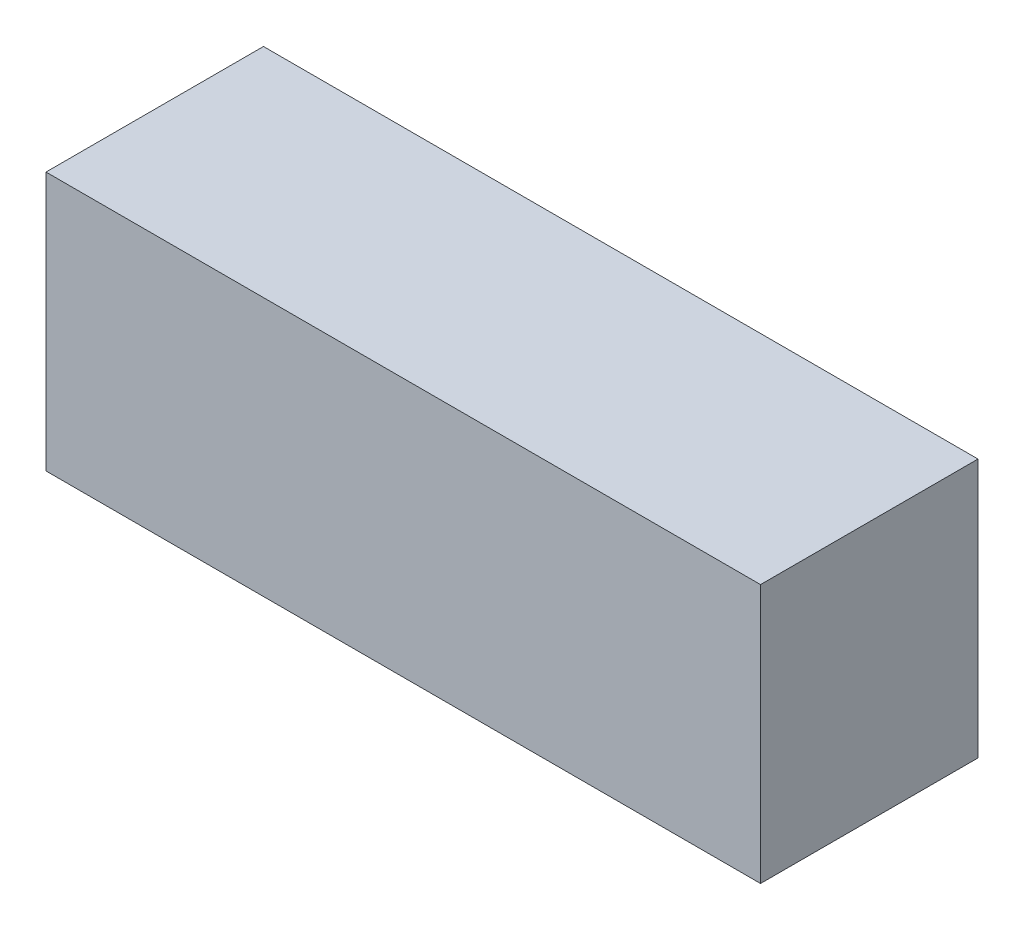
ISO-10303-21;
HEADER;
FILE_DESCRIPTION(('STEP AP214'),'2;1');
FILE_NAME('part.step','',(''),(''),'','','');
FILE_SCHEMA(('AUTOMOTIVE_DESIGN { 1 0 10303 214 1 1 1 1 }'));
ENDSEC;
DATA;
#1=APPLICATION_CONTEXT('core data for automotive mechanical design processes');
#2=APPLICATION_PROTOCOL_DEFINITION('international standard','automotive_design',2000,#1);
#3=PRODUCT_CONTEXT('',#1,'mechanical');
#4=PRODUCT('Part','Part','',(#3));
#5=PRODUCT_RELATED_PRODUCT_CATEGORY('part','',(#4));
#6=PRODUCT_DEFINITION_FORMATION('','',#4);
#7=PRODUCT_DEFINITION_CONTEXT('part definition',#1,'design');
#8=PRODUCT_DEFINITION('design','',#6,#7);
#9=PRODUCT_DEFINITION_SHAPE('','',#8);
#10=(LENGTH_UNIT() NAMED_UNIT(*) SI_UNIT(.MILLI.,.METRE.));
#11=(NAMED_UNIT(*) PLANE_ANGLE_UNIT() SI_UNIT($,.RADIAN.));
#12=(NAMED_UNIT(*) SI_UNIT($,.STERADIAN.) SOLID_ANGLE_UNIT());
#13=UNCERTAINTY_MEASURE_WITH_UNIT(LENGTH_MEASURE(1.E-05),#10,'distance_accuracy_value','');
#14=(GEOMETRIC_REPRESENTATION_CONTEXT(3) GLOBAL_UNCERTAINTY_ASSIGNED_CONTEXT((#13)) GLOBAL_UNIT_ASSIGNED_CONTEXT((#10,
#11,#12)) REPRESENTATION_CONTEXT('',''));
#15=CARTESIAN_POINT('',(0.,0.,0.));
#16=DIRECTION('',(0.,0.,1.));
#17=DIRECTION('',(1.,0.,0.));
#18=AXIS2_PLACEMENT_3D('',#15,#16,#17);
#19=CARTESIAN_POINT('',(26.289,-9.525,16.002));
#20=DIRECTION('',(-1.,0.,0.));
#21=DIRECTION('',(0.,0.,1.));
#22=AXIS2_PLACEMENT_3D('',#19,#20,#21);
#23=PLANE('',#22);
#24=DIRECTION('',(0.,1.,0.));
#25=VECTOR('',#24,1.);
#26=CARTESIAN_POINT('',(26.289,-9.525,0.));
#27=LINE('',#26,#25);
#28=CARTESIAN_POINT('',(26.289,-9.525,0.));
#29=VERTEX_POINT('',#28);
#30=CARTESIAN_POINT('',(26.289,9.525,0.));
#31=VERTEX_POINT('',#30);
#32=EDGE_CURVE('E99',#29,#31,#27,.T.);
#33=ORIENTED_EDGE('',*,*,#32,.T.);
#34=DIRECTION('',(0.,0.,-1.));
#35=VECTOR('',#34,1.);
#36=CARTESIAN_POINT('',(26.289,9.525,16.002));
#37=LINE('',#36,#35);
#38=CARTESIAN_POINT('',(26.289,9.525,16.002));
#39=VERTEX_POINT('',#38);
#40=EDGE_CURVE('E11',#39,#31,#37,.T.);
#41=ORIENTED_EDGE('',*,*,#40,.F.);
#42=DIRECTION('',(0.,1.,0.));
#43=VECTOR('',#42,1.);
#44=CARTESIAN_POINT('',(26.289,-9.525,16.002));
#45=LINE('',#44,#43);
#46=CARTESIAN_POINT('',(26.289,-9.525,16.002));
#47=VERTEX_POINT('',#46);
#48=EDGE_CURVE('E87',#47,#39,#45,.T.);
#49=ORIENTED_EDGE('',*,*,#48,.F.);
#50=DIRECTION('',(0.,0.,-1.));
#51=VECTOR('',#50,1.);
#52=CARTESIAN_POINT('',(26.289,-9.525,16.002));
#53=LINE('',#52,#51);
#54=EDGE_CURVE('E95',#47,#29,#53,.T.);
#55=ORIENTED_EDGE('',*,*,#54,.T.);
#56=EDGE_LOOP('',(#33,#41,#49,#55));
#57=FACE_BOUND('',#56,.T.);
#58=ADVANCED_FACE('F36',(#57),#23,.F.);
#59=CARTESIAN_POINT('',(-26.289,9.525,16.002));
#60=DIRECTION('',(0.,-1.,0.));
#61=DIRECTION('',(0.,0.,-1.));
#62=AXIS2_PLACEMENT_3D('',#59,#60,#61);
#63=PLANE('',#62);
#64=DIRECTION('',(-1.,0.,0.));
#65=VECTOR('',#64,1.);
#66=CARTESIAN_POINT('',(-26.289,9.525,0.));
#67=LINE('',#66,#65);
#68=CARTESIAN_POINT('',(-26.289,9.525,0.));
#69=VERTEX_POINT('',#68);
#70=EDGE_CURVE('E91',#31,#69,#67,.T.);
#71=ORIENTED_EDGE('',*,*,#70,.T.);
#72=DIRECTION('',(0.,0.,-1.));
#73=VECTOR('',#72,1.);
#74=CARTESIAN_POINT('',(-26.289,9.525,16.002));
#75=LINE('',#74,#73);
#76=CARTESIAN_POINT('',(-26.289,9.525,16.002));
#77=VERTEX_POINT('',#76);
#78=EDGE_CURVE('E44',#77,#69,#75,.T.);
#79=ORIENTED_EDGE('',*,*,#78,.F.);
#80=DIRECTION('',(-1.,0.,0.));
#81=VECTOR('',#80,1.);
#82=CARTESIAN_POINT('',(-26.289,9.525,16.002));
#83=LINE('',#82,#81);
#84=EDGE_CURVE('E82',#39,#77,#83,.T.);
#85=ORIENTED_EDGE('',*,*,#84,.F.);
#86=ORIENTED_EDGE('',*,*,#40,.T.);
#87=EDGE_LOOP('',(#71,#79,#85,#86));
#88=FACE_BOUND('',#87,.T.);
#89=ADVANCED_FACE('F90',(#88),#63,.F.);
#90=CARTESIAN_POINT('',(-26.289,-9.525,16.002));
#91=DIRECTION('',(1.,0.,0.));
#92=DIRECTION('',(0.,0.,-1.));
#93=AXIS2_PLACEMENT_3D('',#90,#91,#92);
#94=PLANE('',#93);
#95=DIRECTION('',(0.,-1.,0.));
#96=VECTOR('',#95,1.);
#97=CARTESIAN_POINT('',(-26.289,-9.525,0.));
#98=LINE('',#97,#96);
#99=CARTESIAN_POINT('',(-26.289,-9.525,0.));
#100=VERTEX_POINT('',#99);
#101=EDGE_CURVE('E69',#69,#100,#98,.T.);
#102=ORIENTED_EDGE('',*,*,#101,.T.);
#103=DIRECTION('',(0.,0.,-1.));
#104=VECTOR('',#103,1.);
#105=CARTESIAN_POINT('',(-26.289,-9.525,16.002));
#106=LINE('',#105,#104);
#107=CARTESIAN_POINT('',(-26.289,-9.525,16.002));
#108=VERTEX_POINT('',#107);
#109=EDGE_CURVE('E92',#108,#100,#106,.T.);
#110=ORIENTED_EDGE('',*,*,#109,.F.);
#111=DIRECTION('',(0.,-1.,0.));
#112=VECTOR('',#111,1.);
#113=CARTESIAN_POINT('',(-26.289,-9.525,16.002));
#114=LINE('',#113,#112);
#115=EDGE_CURVE('E85',#77,#108,#114,.T.);
#116=ORIENTED_EDGE('',*,*,#115,.F.);
#117=ORIENTED_EDGE('',*,*,#78,.T.);
#118=EDGE_LOOP('',(#102,#110,#116,#117));
#119=FACE_BOUND('',#118,.T.);
#120=ADVANCED_FACE('F93',(#119),#94,.F.);
#121=CARTESIAN_POINT('',(-26.289,-9.525,16.002));
#122=DIRECTION('',(0.,1.,0.));
#123=DIRECTION('',(0.,0.,1.));
#124=AXIS2_PLACEMENT_3D('',#121,#122,#123);
#125=PLANE('',#124);
#126=DIRECTION('',(1.,0.,0.));
#127=VECTOR('',#126,1.);
#128=CARTESIAN_POINT('',(-26.289,-9.525,0.));
#129=LINE('',#128,#127);
#130=EDGE_CURVE('E75',#100,#29,#129,.T.);
#131=ORIENTED_EDGE('',*,*,#130,.T.);
#132=ORIENTED_EDGE('',*,*,#54,.F.);
#133=DIRECTION('',(1.,0.,0.));
#134=VECTOR('',#133,1.);
#135=CARTESIAN_POINT('',(-26.289,-9.525,16.002));
#136=LINE('',#135,#134);
#137=EDGE_CURVE('E52',#108,#47,#136,.T.);
#138=ORIENTED_EDGE('',*,*,#137,.F.);
#139=ORIENTED_EDGE('',*,*,#109,.T.);
#140=EDGE_LOOP('',(#131,#132,#138,#139));
#141=FACE_BOUND('',#140,.T.);
#142=ADVANCED_FACE('F106',(#141),#125,.F.);
#143=CARTESIAN_POINT('',(0.,0.,16.002));
#144=DIRECTION('',(0.,0.,-1.));
#145=DIRECTION('',(-1.,0.,0.));
#146=AXIS2_PLACEMENT_3D('',#143,#144,#145);
#147=PLANE('',#146);
#148=ORIENTED_EDGE('',*,*,#48,.T.);
#149=ORIENTED_EDGE('',*,*,#84,.T.);
#150=ORIENTED_EDGE('',*,*,#115,.T.);
#151=ORIENTED_EDGE('',*,*,#137,.T.);
#152=EDGE_LOOP('',(#148,#149,#150,#151));
#153=FACE_BOUND('',#152,.T.);
#154=ADVANCED_FACE('F83',(#153),#147,.F.);
#155=CARTESIAN_POINT('',(0.,0.,0.));
#156=DIRECTION('',(0.,0.,-1.));
#157=DIRECTION('',(-1.,0.,0.));
#158=AXIS2_PLACEMENT_3D('',#155,#156,#157);
#159=PLANE('',#158);
#160=ORIENTED_EDGE('',*,*,#32,.F.);
#161=ORIENTED_EDGE('',*,*,#130,.F.);
#162=ORIENTED_EDGE('',*,*,#101,.F.);
#163=ORIENTED_EDGE('',*,*,#70,.F.);
#164=EDGE_LOOP('',(#160,#161,#162,#163));
#165=FACE_BOUND('',#164,.T.);
#166=ADVANCED_FACE('F109',(#165),#159,.T.);
#167=CLOSED_SHELL('',(#58,#89,#120,#142,#154,#166));
#168=MANIFOLD_SOLID_BREP('B2',#167);
#169=ADVANCED_BREP_SHAPE_REPRESENTATION('',(#18,#168),#14);
#170=SHAPE_DEFINITION_REPRESENTATION(#9,#169);
ENDSEC;
END-ISO-10303-21;
